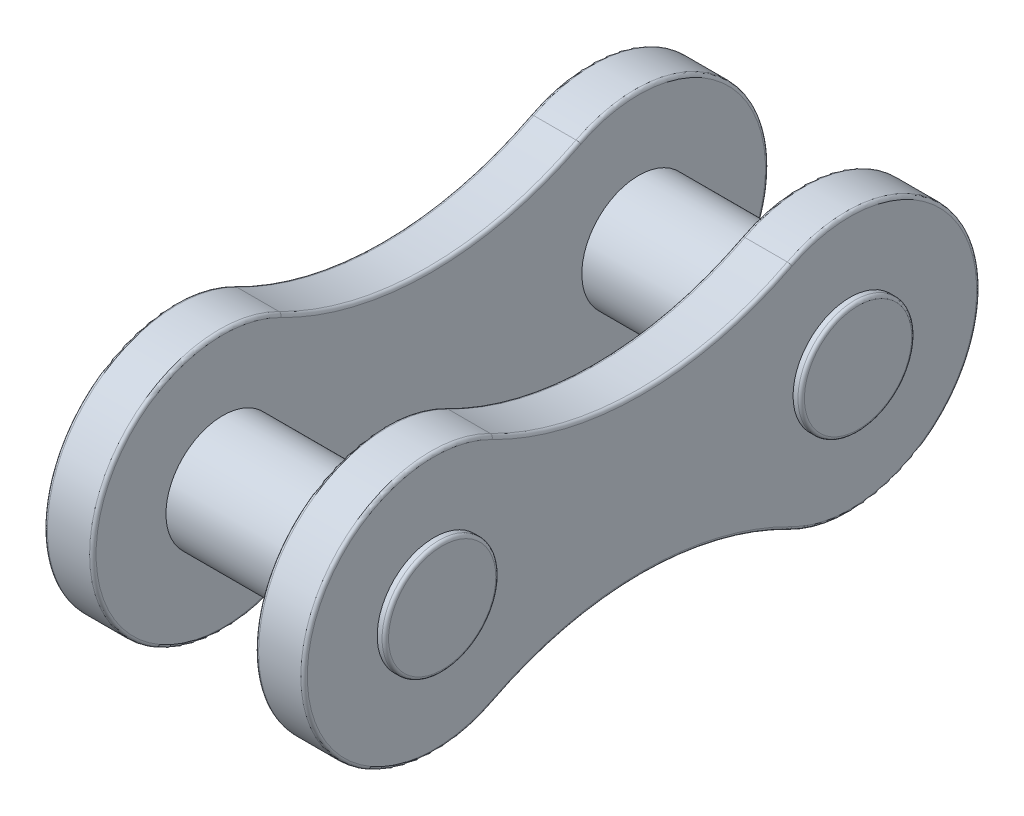
ISO-10303-21;
HEADER;
FILE_DESCRIPTION(('STEP AP214'),'2;1');
FILE_NAME('part.step','',(''),(''),'','','');
FILE_SCHEMA(('AUTOMOTIVE_DESIGN { 1 0 10303 214 1 1 1 1 }'));
ENDSEC;
DATA;
#1=APPLICATION_CONTEXT('core data for automotive mechanical design processes');
#2=APPLICATION_PROTOCOL_DEFINITION('international standard','automotive_design',2000,#1);
#3=PRODUCT_CONTEXT('',#1,'mechanical');
#4=PRODUCT('Part','Part','',(#3));
#5=PRODUCT_RELATED_PRODUCT_CATEGORY('part','',(#4));
#6=PRODUCT_DEFINITION_FORMATION('','',#4);
#7=PRODUCT_DEFINITION_CONTEXT('part definition',#1,'design');
#8=PRODUCT_DEFINITION('design','',#6,#7);
#9=PRODUCT_DEFINITION_SHAPE('','',#8);
#10=(LENGTH_UNIT() NAMED_UNIT(*) SI_UNIT(.MILLI.,.METRE.));
#11=(NAMED_UNIT(*) PLANE_ANGLE_UNIT() SI_UNIT($,.RADIAN.));
#12=(NAMED_UNIT(*) SI_UNIT($,.STERADIAN.) SOLID_ANGLE_UNIT());
#13=UNCERTAINTY_MEASURE_WITH_UNIT(LENGTH_MEASURE(1.E-05),#10,'distance_accuracy_value','');
#14=(GEOMETRIC_REPRESENTATION_CONTEXT(3) GLOBAL_UNCERTAINTY_ASSIGNED_CONTEXT((#13)) GLOBAL_UNIT_ASSIGNED_CONTEXT((#10,
#11,#12)) REPRESENTATION_CONTEXT('',''));
#15=CARTESIAN_POINT('',(0.,0.,0.));
#16=DIRECTION('',(0.,0.,1.));
#17=DIRECTION('',(1.,0.,0.));
#18=AXIS2_PLACEMENT_3D('',#15,#16,#17);
#19=CARTESIAN_POINT('',(4.,6.22613840494251,-3.19925));
#20=DIRECTION('',(1.,0.,0.));
#21=DIRECTION('',(0.,0.,-1.));
#22=AXIS2_PLACEMENT_3D('',#19,#20,#21);
#23=PLANE('',#22);
#24=CARTESIAN_POINT('',(4.,-12.452276809885,0.));
#25=DIRECTION('',(1.,0.,0.));
#26=DIRECTION('',(0.,0.,-1.));
#27=AXIS2_PLACEMENT_3D('',#24,#25,#26);
#28=CIRCLE('',#27,10.1);
#29=CARTESIAN_POINT('',(4.,-3.46884853989654,4.61606071428572));
#30=VERTEX_POINT('',#29);
#31=CARTESIAN_POINT('',(4.,-3.46884853989654,-4.61606071428572));
#32=VERTEX_POINT('',#31);
#33=EDGE_CURVE('E183',#30,#32,#28,.F.);
#34=ORIENTED_EDGE('',*,*,#33,.T.);
#35=CARTESIAN_POINT('',(4.,0.,-6.3985));
#36=DIRECTION('',(1.,0.,0.));
#37=DIRECTION('',(0.,0.,-1.));
#38=AXIS2_PLACEMENT_3D('',#35,#36,#37);
#39=CIRCLE('',#38,3.9);
#40=CARTESIAN_POINT('',(4.,3.46884853989654,-4.61606071428572));
#41=VERTEX_POINT('',#40);
#42=EDGE_CURVE('E161',#32,#41,#39,.T.);
#43=ORIENTED_EDGE('',*,*,#42,.T.);
#44=CARTESIAN_POINT('',(4.,12.452276809885,0.));
#45=DIRECTION('',(1.,0.,0.));
#46=DIRECTION('',(0.,0.,-1.));
#47=AXIS2_PLACEMENT_3D('',#44,#45,#46);
#48=CIRCLE('',#47,10.1);
#49=CARTESIAN_POINT('',(4.,3.46884853989654,4.61606071428571));
#50=VERTEX_POINT('',#49);
#51=EDGE_CURVE('E171',#41,#50,#48,.F.);
#52=ORIENTED_EDGE('',*,*,#51,.T.);
#53=CARTESIAN_POINT('',(4.,0.,6.3985));
#54=DIRECTION('',(1.,0.,0.));
#55=DIRECTION('',(0.,0.,-1.));
#56=AXIS2_PLACEMENT_3D('',#53,#54,#55);
#57=CIRCLE('',#56,3.9);
#58=EDGE_CURVE('E178',#50,#30,#57,.T.);
#59=ORIENTED_EDGE('',*,*,#58,.T.);
#60=EDGE_LOOP('',(#34,#43,#52,#59));
#61=FACE_BOUND('',#60,.T.);
#62=CARTESIAN_POINT('',(4.,0.,6.3985));
#63=DIRECTION('',(1.,0.,0.));
#64=DIRECTION('',(0.,0.,-1.));
#65=AXIS2_PLACEMENT_3D('',#62,#63,#64);
#66=CIRCLE('',#65,1.74999999999992);
#67=CARTESIAN_POINT('',(4.,0.,4.64850000000008));
#68=VERTEX_POINT('',#67);
#69=EDGE_CURVE('E402',#68,#68,#66,.T.);
#70=ORIENTED_EDGE('',*,*,#69,.F.);
#71=EDGE_LOOP('',(#70));
#72=FACE_BOUND('',#71,.T.);
#73=CARTESIAN_POINT('',(4.,0.,-6.3985));
#74=DIRECTION('',(1.,0.,0.));
#75=DIRECTION('',(0.,0.,1.));
#76=AXIS2_PLACEMENT_3D('',#73,#74,#75);
#77=CIRCLE('',#76,1.74999999999992);
#78=CARTESIAN_POINT('',(4.,0.,-4.64850000000008));
#79=VERTEX_POINT('',#78);
#80=EDGE_CURVE('E386',#79,#79,#77,.T.);
#81=ORIENTED_EDGE('',*,*,#80,.F.);
#82=EDGE_LOOP('',(#81));
#83=FACE_BOUND('',#82,.T.);
#84=ADVANCED_FACE('F41',(#61,#72,#83),#23,.T.);
#85=CARTESIAN_POINT('',(2.5,6.22613840494251,-3.19925));
#86=DIRECTION('',(1.,0.,0.));
#87=DIRECTION('',(0.,0.,-1.));
#88=AXIS2_PLACEMENT_3D('',#85,#86,#87);
#89=PLANE('',#88);
#90=CARTESIAN_POINT('',(2.5,12.452276809885,0.));
#91=DIRECTION('',(1.,0.,0.));
#92=DIRECTION('',(0.,0.,-1.));
#93=AXIS2_PLACEMENT_3D('',#90,#91,#92);
#94=CIRCLE('',#93,10.1);
#95=CARTESIAN_POINT('',(2.5,3.46884853989654,4.61606071428571));
#96=VERTEX_POINT('',#95);
#97=CARTESIAN_POINT('',(2.5,3.46884853989654,-4.61606071428572));
#98=VERTEX_POINT('',#97);
#99=EDGE_CURVE('E210',#96,#98,#94,.T.);
#100=ORIENTED_EDGE('',*,*,#99,.T.);
#101=CARTESIAN_POINT('',(2.5,0.,-6.3985));
#102=DIRECTION('',(1.,0.,0.));
#103=DIRECTION('',(0.,0.,-1.));
#104=AXIS2_PLACEMENT_3D('',#101,#102,#103);
#105=CIRCLE('',#104,3.9);
#106=CARTESIAN_POINT('',(2.5,-3.46884853989654,-4.61606071428572));
#107=VERTEX_POINT('',#106);
#108=EDGE_CURVE('E219',#98,#107,#105,.F.);
#109=ORIENTED_EDGE('',*,*,#108,.T.);
#110=CARTESIAN_POINT('',(2.5,-12.452276809885,0.));
#111=DIRECTION('',(1.,0.,0.));
#112=DIRECTION('',(0.,0.,-1.));
#113=AXIS2_PLACEMENT_3D('',#110,#111,#112);
#114=CIRCLE('',#113,10.1);
#115=CARTESIAN_POINT('',(2.5,-3.46884853989654,4.61606071428572));
#116=VERTEX_POINT('',#115);
#117=EDGE_CURVE('E216',#107,#116,#114,.T.);
#118=ORIENTED_EDGE('',*,*,#117,.T.);
#119=CARTESIAN_POINT('',(2.5,0.,6.3985));
#120=DIRECTION('',(1.,0.,0.));
#121=DIRECTION('',(0.,0.,-1.));
#122=AXIS2_PLACEMENT_3D('',#119,#120,#121);
#123=CIRCLE('',#122,3.9);
#124=EDGE_CURVE('E213',#116,#96,#123,.F.);
#125=ORIENTED_EDGE('',*,*,#124,.T.);
#126=EDGE_LOOP('',(#100,#109,#118,#125));
#127=FACE_BOUND('',#126,.T.);
#128=CARTESIAN_POINT('',(2.5,0.,6.3985));
#129=DIRECTION('',(1.,0.,0.));
#130=DIRECTION('',(0.,0.,-1.));
#131=AXIS2_PLACEMENT_3D('',#128,#129,#130);
#132=CIRCLE('',#131,1.74999999999992);
#133=CARTESIAN_POINT('',(2.5,0.,4.64850000000008));
#134=VERTEX_POINT('',#133);
#135=EDGE_CURVE('E473',#134,#134,#132,.F.);
#136=ORIENTED_EDGE('',*,*,#135,.F.);
#137=EDGE_LOOP('',(#136));
#138=FACE_BOUND('',#137,.T.);
#139=CARTESIAN_POINT('',(2.5,0.,-6.3985));
#140=DIRECTION('',(1.,0.,0.));
#141=DIRECTION('',(0.,0.,-1.));
#142=AXIS2_PLACEMENT_3D('',#139,#140,#141);
#143=CIRCLE('',#142,1.74999999999992);
#144=CARTESIAN_POINT('',(2.5,0.,-8.14849999999992));
#145=VERTEX_POINT('',#144);
#146=EDGE_CURVE('E379',#145,#145,#143,.F.);
#147=ORIENTED_EDGE('',*,*,#146,.F.);
#148=EDGE_LOOP('',(#147));
#149=FACE_BOUND('',#148,.T.);
#150=ADVANCED_FACE('F466',(#127,#138,#149),#89,.F.);
#151=CARTESIAN_POINT('',(4.,12.452276809885,0.));
#152=DIRECTION('',(-1.,0.,0.));
#153=DIRECTION('',(0.,0.,1.));
#154=AXIS2_PLACEMENT_3D('',#151,#152,#153);
#155=CYLINDRICAL_SURFACE('',#154,10.);
#156=DIRECTION('',(-1.,0.,0.));
#157=VECTOR('',#156,1.);
#158=CARTESIAN_POINT('',(4.,3.55779337425286,4.57035714285714));
#159=LINE('',#158,#157);
#160=CARTESIAN_POINT('',(3.9,3.55779337425286,4.57035714285714));
#161=VERTEX_POINT('',#160);
#162=CARTESIAN_POINT('',(2.6,3.55779337425286,4.57035714285714));
#163=VERTEX_POINT('',#162);
#164=EDGE_CURVE('E418',#161,#163,#159,.T.);
#165=ORIENTED_EDGE('',*,*,#164,.F.);
#166=CARTESIAN_POINT('',(3.9,12.452276809885,0.));
#167=DIRECTION('',(1.,0.,0.));
#168=DIRECTION('',(0.,0.,-1.));
#169=AXIS2_PLACEMENT_3D('',#166,#167,#168);
#170=CIRCLE('',#169,10.);
#171=CARTESIAN_POINT('',(3.9,3.55779337425286,-4.57035714285714));
#172=VERTEX_POINT('',#171);
#173=EDGE_CURVE('E269',#161,#172,#170,.T.);
#174=ORIENTED_EDGE('',*,*,#173,.T.);
#175=DIRECTION('',(-1.,0.,0.));
#176=VECTOR('',#175,1.);
#177=CARTESIAN_POINT('',(4.,3.55779337425286,-4.57035714285714));
#178=LINE('',#177,#176);
#179=CARTESIAN_POINT('',(2.6,3.55779337425286,-4.57035714285714));
#180=VERTEX_POINT('',#179);
#181=EDGE_CURVE('E406',#172,#180,#178,.T.);
#182=ORIENTED_EDGE('',*,*,#181,.T.);
#183=CARTESIAN_POINT('',(2.6,12.452276809885,0.));
#184=DIRECTION('',(1.,0.,0.));
#185=DIRECTION('',(0.,0.,-1.));
#186=AXIS2_PLACEMENT_3D('',#183,#184,#185);
#187=CIRCLE('',#186,10.);
#188=EDGE_CURVE('E266',#180,#163,#187,.F.);
#189=ORIENTED_EDGE('',*,*,#188,.T.);
#190=EDGE_LOOP('',(#165,#174,#182,#189));
#191=FACE_BOUND('',#190,.T.);
#192=ADVANCED_FACE('F454',(#191),#155,.F.);
#193=CARTESIAN_POINT('',(4.,0.,6.3985));
#194=DIRECTION('',(-1.,0.,0.));
#195=DIRECTION('',(0.,0.,1.));
#196=AXIS2_PLACEMENT_3D('',#193,#194,#195);
#197=CYLINDRICAL_SURFACE('',#196,4.);
#198=DIRECTION('',(-1.,0.,0.));
#199=VECTOR('',#198,1.);
#200=CARTESIAN_POINT('',(4.,-3.55779337425286,4.57035714285715));
#201=LINE('',#200,#199);
#202=CARTESIAN_POINT('',(3.9,-3.55779337425286,4.57035714285715));
#203=VERTEX_POINT('',#202);
#204=CARTESIAN_POINT('',(2.6,-3.55779337425286,4.57035714285715));
#205=VERTEX_POINT('',#204);
#206=EDGE_CURVE('E414',#203,#205,#201,.T.);
#207=ORIENTED_EDGE('',*,*,#206,.F.);
#208=CARTESIAN_POINT('',(3.9,0.,6.3985));
#209=DIRECTION('',(1.,0.,0.));
#210=DIRECTION('',(0.,0.,-1.));
#211=AXIS2_PLACEMENT_3D('',#208,#209,#210);
#212=CIRCLE('',#211,4.);
#213=EDGE_CURVE('E207',#203,#161,#212,.F.);
#214=ORIENTED_EDGE('',*,*,#213,.T.);
#215=ORIENTED_EDGE('',*,*,#164,.T.);
#216=CARTESIAN_POINT('',(2.6,0.,6.3985));
#217=DIRECTION('',(1.,0.,0.));
#218=DIRECTION('',(0.,0.,-1.));
#219=AXIS2_PLACEMENT_3D('',#216,#217,#218);
#220=CIRCLE('',#219,4.);
#221=EDGE_CURVE('E204',#163,#205,#220,.T.);
#222=ORIENTED_EDGE('',*,*,#221,.T.);
#223=EDGE_LOOP('',(#207,#214,#215,#222));
#224=FACE_BOUND('',#223,.T.);
#225=ADVANCED_FACE('F457',(#224),#197,.T.);
#226=CARTESIAN_POINT('',(4.,-12.452276809885,0.));
#227=DIRECTION('',(-1.,0.,0.));
#228=DIRECTION('',(0.,0.,1.));
#229=AXIS2_PLACEMENT_3D('',#226,#227,#228);
#230=CYLINDRICAL_SURFACE('',#229,10.);
#231=DIRECTION('',(-1.,0.,0.));
#232=VECTOR('',#231,1.);
#233=CARTESIAN_POINT('',(4.,-3.55779337425286,-4.57035714285714));
#234=LINE('',#233,#232);
#235=CARTESIAN_POINT('',(3.9,-3.55779337425286,-4.57035714285714));
#236=VERTEX_POINT('',#235);
#237=CARTESIAN_POINT('',(2.6,-3.55779337425286,-4.57035714285714));
#238=VERTEX_POINT('',#237);
#239=EDGE_CURVE('E410',#236,#238,#234,.T.);
#240=ORIENTED_EDGE('',*,*,#239,.F.);
#241=CARTESIAN_POINT('',(3.9,-12.452276809885,0.));
#242=DIRECTION('',(1.,0.,0.));
#243=DIRECTION('',(0.,0.,-1.));
#244=AXIS2_PLACEMENT_3D('',#241,#242,#243);
#245=CIRCLE('',#244,10.);
#246=EDGE_CURVE('E201',#236,#203,#245,.T.);
#247=ORIENTED_EDGE('',*,*,#246,.T.);
#248=ORIENTED_EDGE('',*,*,#206,.T.);
#249=CARTESIAN_POINT('',(2.6,-12.452276809885,0.));
#250=DIRECTION('',(1.,0.,0.));
#251=DIRECTION('',(0.,0.,-1.));
#252=AXIS2_PLACEMENT_3D('',#249,#250,#251);
#253=CIRCLE('',#252,10.);
#254=EDGE_CURVE('E198',#205,#238,#253,.F.);
#255=ORIENTED_EDGE('',*,*,#254,.T.);
#256=EDGE_LOOP('',(#240,#247,#248,#255));
#257=FACE_BOUND('',#256,.T.);
#258=ADVANCED_FACE('F440',(#257),#230,.F.);
#259=CARTESIAN_POINT('',(4.,0.,-6.3985));
#260=DIRECTION('',(-1.,0.,0.));
#261=DIRECTION('',(0.,0.,1.));
#262=AXIS2_PLACEMENT_3D('',#259,#260,#261);
#263=CYLINDRICAL_SURFACE('',#262,4.);
#264=ORIENTED_EDGE('',*,*,#181,.F.);
#265=CARTESIAN_POINT('',(3.9,0.,-6.3985));
#266=DIRECTION('',(1.,0.,0.));
#267=DIRECTION('',(0.,0.,-1.));
#268=AXIS2_PLACEMENT_3D('',#265,#266,#267);
#269=CIRCLE('',#268,4.);
#270=EDGE_CURVE('E163',#172,#236,#269,.F.);
#271=ORIENTED_EDGE('',*,*,#270,.T.);
#272=ORIENTED_EDGE('',*,*,#239,.T.);
#273=CARTESIAN_POINT('',(2.6,0.,-6.3985));
#274=DIRECTION('',(1.,0.,0.));
#275=DIRECTION('',(0.,0.,-1.));
#276=AXIS2_PLACEMENT_3D('',#273,#274,#275);
#277=CIRCLE('',#276,4.);
#278=EDGE_CURVE('E186',#238,#180,#277,.T.);
#279=ORIENTED_EDGE('',*,*,#278,.T.);
#280=EDGE_LOOP('',(#264,#271,#272,#279));
#281=FACE_BOUND('',#280,.T.);
#282=ADVANCED_FACE('F438',(#281),#263,.T.);
#283=CARTESIAN_POINT('',(4.25,0.,-6.3985));
#284=DIRECTION('',(-1.,0.,0.));
#285=DIRECTION('',(0.,0.,1.));
#286=AXIS2_PLACEMENT_3D('',#283,#284,#285);
#287=CYLINDRICAL_SURFACE('',#286,1.74999999999992);
#288=CARTESIAN_POINT('',(-2.5,0.,-6.3985));
#289=DIRECTION('',(1.,0.,0.));
#290=DIRECTION('',(0.,0.,-1.));
#291=AXIS2_PLACEMENT_3D('',#288,#289,#290);
#292=CIRCLE('',#291,1.74999999999992);
#293=CARTESIAN_POINT('',(-2.5,0.,-8.14849999999992));
#294=VERTEX_POINT('',#293);
#295=EDGE_CURVE('E391',#294,#294,#292,.T.);
#296=ORIENTED_EDGE('',*,*,#295,.T.);
#297=EDGE_LOOP('',(#296));
#298=FACE_BOUND('',#297,.T.);
#299=ORIENTED_EDGE('',*,*,#146,.T.);
#300=EDGE_LOOP('',(#299));
#301=FACE_BOUND('',#300,.T.);
#302=ADVANCED_FACE('F476',(#298,#301),#287,.T.);
#303=CARTESIAN_POINT('',(4.15,0.,-6.3985));
#304=DIRECTION('',(1.,0.,0.));
#305=DIRECTION('',(0.,0.,-1.));
#306=AXIS2_PLACEMENT_3D('',#303,#304,#305);
#307=CIRCLE('',#306,1.74999999999992);
#308=CARTESIAN_POINT('',(4.15,0.,-8.14849999999992));
#309=VERTEX_POINT('',#308);
#310=EDGE_CURVE('E292',#309,#309,#307,.F.);
#311=ORIENTED_EDGE('',*,*,#310,.T.);
#312=EDGE_LOOP('',(#311));
#313=FACE_BOUND('',#312,.T.);
#314=ORIENTED_EDGE('',*,*,#80,.T.);
#315=EDGE_LOOP('',(#314));
#316=FACE_BOUND('',#315,.T.);
#317=ADVANCED_FACE('F478',(#313,#316),#287,.T.);
#318=CARTESIAN_POINT('',(4.25,0.,-6.3985));
#319=DIRECTION('',(1.,0.,0.));
#320=DIRECTION('',(0.,0.,-1.));
#321=AXIS2_PLACEMENT_3D('',#318,#319,#320);
#322=PLANE('',#321);
#323=CARTESIAN_POINT('',(4.25,0.,-6.3985));
#324=DIRECTION('',(1.,0.,0.));
#325=DIRECTION('',(0.,0.,-1.));
#326=AXIS2_PLACEMENT_3D('',#323,#324,#325);
#327=CIRCLE('',#326,1.64999999999992);
#328=CARTESIAN_POINT('',(4.25,0.,-8.04849999999992));
#329=VERTEX_POINT('',#328);
#330=EDGE_CURVE('E288',#329,#329,#327,.T.);
#331=ORIENTED_EDGE('',*,*,#330,.T.);
#332=EDGE_LOOP('',(#331));
#333=FACE_BOUND('',#332,.T.);
#334=ADVANCED_FACE('F486',(#333),#322,.T.);
#335=CARTESIAN_POINT('',(-4.,0.,6.3985));
#336=DIRECTION('',(1.,0.,0.));
#337=DIRECTION('',(0.,0.,-1.));
#338=AXIS2_PLACEMENT_3D('',#335,#336,#337);
#339=CYLINDRICAL_SURFACE('',#338,4.);
#340=DIRECTION('',(1.,0.,0.));
#341=VECTOR('',#340,1.);
#342=CARTESIAN_POINT('',(-4.,3.55779337425286,4.57035714285714));
#343=LINE('',#342,#341);
#344=CARTESIAN_POINT('',(-3.9,3.55779337425286,4.57035714285714));
#345=VERTEX_POINT('',#344);
#346=CARTESIAN_POINT('',(-2.6,3.55779337425286,4.57035714285714));
#347=VERTEX_POINT('',#346);
#348=EDGE_CURVE('E369',#345,#347,#343,.T.);
#349=ORIENTED_EDGE('',*,*,#348,.F.);
#350=CARTESIAN_POINT('',(-3.9,0.,6.3985));
#351=DIRECTION('',(1.,0.,0.));
#352=DIRECTION('',(0.,0.,-1.));
#353=AXIS2_PLACEMENT_3D('',#350,#351,#352);
#354=CIRCLE('',#353,4.);
#355=CARTESIAN_POINT('',(-3.9,-3.55779337425286,4.57035714285715));
#356=VERTEX_POINT('',#355);
#357=EDGE_CURVE('E253',#345,#356,#354,.T.);
#358=ORIENTED_EDGE('',*,*,#357,.T.);
#359=DIRECTION('',(1.,0.,0.));
#360=VECTOR('',#359,1.);
#361=CARTESIAN_POINT('',(-4.,-3.55779337425286,4.57035714285715));
#362=LINE('',#361,#360);
#363=CARTESIAN_POINT('',(-2.6,-3.55779337425286,4.57035714285715));
#364=VERTEX_POINT('',#363);
#365=EDGE_CURVE('E372',#356,#364,#362,.T.);
#366=ORIENTED_EDGE('',*,*,#365,.T.);
#367=CARTESIAN_POINT('',(-2.6,0.,6.3985));
#368=DIRECTION('',(1.,0.,0.));
#369=DIRECTION('',(0.,0.,-1.));
#370=AXIS2_PLACEMENT_3D('',#367,#368,#369);
#371=CIRCLE('',#370,4.);
#372=EDGE_CURVE('E250',#364,#347,#371,.F.);
#373=ORIENTED_EDGE('',*,*,#372,.T.);
#374=EDGE_LOOP('',(#349,#358,#366,#373));
#375=FACE_BOUND('',#374,.T.);
#376=ADVANCED_FACE('F368',(#375),#339,.T.);
#377=CARTESIAN_POINT('',(-4.,12.452276809885,0.));
#378=DIRECTION('',(1.,0.,0.));
#379=DIRECTION('',(0.,0.,-1.));
#380=AXIS2_PLACEMENT_3D('',#377,#378,#379);
#381=CYLINDRICAL_SURFACE('',#380,10.);
#382=DIRECTION('',(1.,0.,0.));
#383=VECTOR('',#382,1.);
#384=CARTESIAN_POINT('',(-4.,3.55779337425286,-4.57035714285714));
#385=LINE('',#384,#383);
#386=CARTESIAN_POINT('',(-3.9,3.55779337425286,-4.57035714285714));
#387=VERTEX_POINT('',#386);
#388=CARTESIAN_POINT('',(-2.6,3.55779337425286,-4.57035714285714));
#389=VERTEX_POINT('',#388);
#390=EDGE_CURVE('E380',#387,#389,#385,.T.);
#391=ORIENTED_EDGE('',*,*,#390,.F.);
#392=CARTESIAN_POINT('',(-3.9,12.452276809885,0.));
#393=DIRECTION('',(1.,0.,0.));
#394=DIRECTION('',(0.,0.,-1.));
#395=AXIS2_PLACEMENT_3D('',#392,#393,#394);
#396=CIRCLE('',#395,10.);
#397=EDGE_CURVE('E11',#387,#345,#396,.F.);
#398=ORIENTED_EDGE('',*,*,#397,.T.);
#399=ORIENTED_EDGE('',*,*,#348,.T.);
#400=CARTESIAN_POINT('',(-2.6,12.452276809885,0.));
#401=DIRECTION('',(1.,0.,0.));
#402=DIRECTION('',(0.,0.,-1.));
#403=AXIS2_PLACEMENT_3D('',#400,#401,#402);
#404=CIRCLE('',#403,10.);
#405=EDGE_CURVE('E51',#347,#389,#404,.T.);
#406=ORIENTED_EDGE('',*,*,#405,.T.);
#407=EDGE_LOOP('',(#391,#398,#399,#406));
#408=FACE_BOUND('',#407,.T.);
#409=ADVANCED_FACE('F375',(#408),#381,.F.);
#410=CARTESIAN_POINT('',(-4.,0.,-6.3985));
#411=DIRECTION('',(1.,0.,0.));
#412=DIRECTION('',(0.,0.,-1.));
#413=AXIS2_PLACEMENT_3D('',#410,#411,#412);
#414=CYLINDRICAL_SURFACE('',#413,4.);
#415=DIRECTION('',(1.,0.,0.));
#416=VECTOR('',#415,1.);
#417=CARTESIAN_POINT('',(-4.,-3.55779337425286,-4.57035714285714));
#418=LINE('',#417,#416);
#419=CARTESIAN_POINT('',(-3.9,-3.55779337425286,-4.57035714285714));
#420=VERTEX_POINT('',#419);
#421=CARTESIAN_POINT('',(-2.6,-3.55779337425286,-4.57035714285714));
#422=VERTEX_POINT('',#421);
#423=EDGE_CURVE('E388',#420,#422,#418,.T.);
#424=ORIENTED_EDGE('',*,*,#423,.F.);
#425=CARTESIAN_POINT('',(-3.9,0.,-6.3985));
#426=DIRECTION('',(1.,0.,0.));
#427=DIRECTION('',(0.,0.,-1.));
#428=AXIS2_PLACEMENT_3D('',#425,#426,#427);
#429=CIRCLE('',#428,4.);
#430=EDGE_CURVE('E227',#420,#387,#429,.T.);
#431=ORIENTED_EDGE('',*,*,#430,.T.);
#432=ORIENTED_EDGE('',*,*,#390,.T.);
#433=CARTESIAN_POINT('',(-2.6,0.,-6.3985));
#434=DIRECTION('',(1.,0.,0.));
#435=DIRECTION('',(0.,0.,-1.));
#436=AXIS2_PLACEMENT_3D('',#433,#434,#435);
#437=CIRCLE('',#436,4.);
#438=EDGE_CURVE('E223',#389,#422,#437,.F.);
#439=ORIENTED_EDGE('',*,*,#438,.T.);
#440=EDGE_LOOP('',(#424,#431,#432,#439));
#441=FACE_BOUND('',#440,.T.);
#442=ADVANCED_FACE('F596',(#441),#414,.T.);
#443=CARTESIAN_POINT('',(-4.,-12.452276809885,0.));
#444=DIRECTION('',(1.,0.,0.));
#445=DIRECTION('',(0.,0.,-1.));
#446=AXIS2_PLACEMENT_3D('',#443,#444,#445);
#447=CYLINDRICAL_SURFACE('',#446,10.);
#448=ORIENTED_EDGE('',*,*,#365,.F.);
#449=CARTESIAN_POINT('',(-3.9,-12.452276809885,0.));
#450=DIRECTION('',(1.,0.,0.));
#451=DIRECTION('',(0.,0.,-1.));
#452=AXIS2_PLACEMENT_3D('',#449,#450,#451);
#453=CIRCLE('',#452,10.);
#454=EDGE_CURVE('E247',#356,#420,#453,.F.);
#455=ORIENTED_EDGE('',*,*,#454,.T.);
#456=ORIENTED_EDGE('',*,*,#423,.T.);
#457=CARTESIAN_POINT('',(-2.6,-12.452276809885,0.));
#458=DIRECTION('',(1.,0.,0.));
#459=DIRECTION('',(0.,0.,-1.));
#460=AXIS2_PLACEMENT_3D('',#457,#458,#459);
#461=CIRCLE('',#460,10.);
#462=EDGE_CURVE('E244',#422,#364,#461,.T.);
#463=ORIENTED_EDGE('',*,*,#462,.T.);
#464=EDGE_LOOP('',(#448,#455,#456,#463));
#465=FACE_BOUND('',#464,.T.);
#466=ADVANCED_FACE('F590',(#465),#447,.F.);
#467=CARTESIAN_POINT('',(-4.,-6.22613840494251,3.19925));
#468=DIRECTION('',(1.,0.,0.));
#469=DIRECTION('',(0.,0.,-1.));
#470=AXIS2_PLACEMENT_3D('',#467,#468,#469);
#471=PLANE('',#470);
#472=CARTESIAN_POINT('',(-4.,12.452276809885,0.));
#473=DIRECTION('',(1.,0.,0.));
#474=DIRECTION('',(0.,0.,-1.));
#475=AXIS2_PLACEMENT_3D('',#472,#473,#474);
#476=CIRCLE('',#475,10.1);
#477=CARTESIAN_POINT('',(-4.,3.46884853989654,4.61606071428571));
#478=VERTEX_POINT('',#477);
#479=CARTESIAN_POINT('',(-4.,3.46884853989654,-4.61606071428571));
#480=VERTEX_POINT('',#479);
#481=EDGE_CURVE('E231',#478,#480,#476,.T.);
#482=ORIENTED_EDGE('',*,*,#481,.T.);
#483=CARTESIAN_POINT('',(-4.,0.,-6.3985));
#484=DIRECTION('',(1.,0.,0.));
#485=DIRECTION('',(0.,0.,-1.));
#486=AXIS2_PLACEMENT_3D('',#483,#484,#485);
#487=CIRCLE('',#486,3.9);
#488=CARTESIAN_POINT('',(-4.,-3.46884853989654,-4.61606071428572));
#489=VERTEX_POINT('',#488);
#490=EDGE_CURVE('E240',#480,#489,#487,.F.);
#491=ORIENTED_EDGE('',*,*,#490,.T.);
#492=CARTESIAN_POINT('',(-4.,-12.452276809885,0.));
#493=DIRECTION('',(1.,0.,0.));
#494=DIRECTION('',(0.,0.,-1.));
#495=AXIS2_PLACEMENT_3D('',#492,#493,#494);
#496=CIRCLE('',#495,10.1);
#497=CARTESIAN_POINT('',(-4.,-3.46884853989654,4.61606071428572));
#498=VERTEX_POINT('',#497);
#499=EDGE_CURVE('E237',#489,#498,#496,.T.);
#500=ORIENTED_EDGE('',*,*,#499,.T.);
#501=CARTESIAN_POINT('',(-4.,0.,6.3985));
#502=DIRECTION('',(1.,0.,0.));
#503=DIRECTION('',(0.,0.,-1.));
#504=AXIS2_PLACEMENT_3D('',#501,#502,#503);
#505=CIRCLE('',#504,3.9);
#506=EDGE_CURVE('E234',#498,#478,#505,.F.);
#507=ORIENTED_EDGE('',*,*,#506,.T.);
#508=EDGE_LOOP('',(#482,#491,#500,#507));
#509=FACE_BOUND('',#508,.T.);
#510=CARTESIAN_POINT('',(-4.,0.,6.3985));
#511=DIRECTION('',(1.,0.,0.));
#512=DIRECTION('',(0.,0.,-1.));
#513=AXIS2_PLACEMENT_3D('',#510,#511,#512);
#514=CIRCLE('',#513,1.74999999999992);
#515=CARTESIAN_POINT('',(-4.,0.,4.64850000000008));
#516=VERTEX_POINT('',#515);
#517=EDGE_CURVE('E314',#516,#516,#514,.F.);
#518=ORIENTED_EDGE('',*,*,#517,.F.);
#519=EDGE_LOOP('',(#518));
#520=FACE_BOUND('',#519,.T.);
#521=CARTESIAN_POINT('',(-4.,0.,-6.3985));
#522=DIRECTION('',(1.,0.,0.));
#523=DIRECTION('',(0.,0.,-1.));
#524=AXIS2_PLACEMENT_3D('',#521,#522,#523);
#525=CIRCLE('',#524,1.74999999999992);
#526=CARTESIAN_POINT('',(-4.,0.,-8.14849999999992));
#527=VERTEX_POINT('',#526);
#528=EDGE_CURVE('E179',#527,#527,#525,.T.);
#529=ORIENTED_EDGE('',*,*,#528,.T.);
#530=EDGE_LOOP('',(#529));
#531=FACE_BOUND('',#530,.T.);
#532=ADVANCED_FACE('F581',(#509,#520,#531),#471,.F.);
#533=CARTESIAN_POINT('',(-2.5,-6.22613840494251,3.19925));
#534=DIRECTION('',(1.,0.,0.));
#535=DIRECTION('',(0.,0.,-1.));
#536=AXIS2_PLACEMENT_3D('',#533,#534,#535);
#537=PLANE('',#536);
#538=CARTESIAN_POINT('',(-2.5,-12.452276809885,0.));
#539=DIRECTION('',(1.,0.,0.));
#540=DIRECTION('',(0.,0.,-1.));
#541=AXIS2_PLACEMENT_3D('',#538,#539,#540);
#542=CIRCLE('',#541,10.1);
#543=CARTESIAN_POINT('',(-2.5,-3.46884853989654,4.61606071428572));
#544=VERTEX_POINT('',#543);
#545=CARTESIAN_POINT('',(-2.5,-3.46884853989654,-4.61606071428572));
#546=VERTEX_POINT('',#545);
#547=EDGE_CURVE('E59',#544,#546,#542,.F.);
#548=ORIENTED_EDGE('',*,*,#547,.T.);
#549=CARTESIAN_POINT('',(-2.5,0.,-6.3985));
#550=DIRECTION('',(1.,0.,0.));
#551=DIRECTION('',(0.,0.,-1.));
#552=AXIS2_PLACEMENT_3D('',#549,#550,#551);
#553=CIRCLE('',#552,3.9);
#554=CARTESIAN_POINT('',(-2.5,3.46884853989654,-4.61606071428571));
#555=VERTEX_POINT('',#554);
#556=EDGE_CURVE('E263',#546,#555,#553,.T.);
#557=ORIENTED_EDGE('',*,*,#556,.T.);
#558=CARTESIAN_POINT('',(-2.5,12.452276809885,0.));
#559=DIRECTION('',(1.,0.,0.));
#560=DIRECTION('',(0.,0.,-1.));
#561=AXIS2_PLACEMENT_3D('',#558,#559,#560);
#562=CIRCLE('',#561,10.1);
#563=CARTESIAN_POINT('',(-2.5,3.46884853989654,4.61606071428571));
#564=VERTEX_POINT('',#563);
#565=EDGE_CURVE('E256',#555,#564,#562,.F.);
#566=ORIENTED_EDGE('',*,*,#565,.T.);
#567=CARTESIAN_POINT('',(-2.5,0.,6.3985));
#568=DIRECTION('',(1.,0.,0.));
#569=DIRECTION('',(0.,0.,-1.));
#570=AXIS2_PLACEMENT_3D('',#567,#568,#569);
#571=CIRCLE('',#570,3.9);
#572=EDGE_CURVE('E64',#564,#544,#571,.T.);
#573=ORIENTED_EDGE('',*,*,#572,.T.);
#574=EDGE_LOOP('',(#548,#557,#566,#573));
#575=FACE_BOUND('',#574,.T.);
#576=CARTESIAN_POINT('',(-2.5,0.,6.3985));
#577=DIRECTION('',(1.,0.,0.));
#578=DIRECTION('',(0.,0.,-1.));
#579=AXIS2_PLACEMENT_3D('',#576,#577,#578);
#580=CIRCLE('',#579,1.74999999999992);
#581=CARTESIAN_POINT('',(-2.5,0.,4.64850000000008));
#582=VERTEX_POINT('',#581);
#583=EDGE_CURVE('E627',#582,#582,#580,.T.);
#584=ORIENTED_EDGE('',*,*,#583,.F.);
#585=EDGE_LOOP('',(#584));
#586=FACE_BOUND('',#585,.T.);
#587=ORIENTED_EDGE('',*,*,#295,.F.);
#588=EDGE_LOOP('',(#587));
#589=FACE_BOUND('',#588,.T.);
#590=ADVANCED_FACE('F576',(#575,#586,#589),#537,.T.);
#591=CARTESIAN_POINT('',(-4.25,0.,-6.3985));
#592=DIRECTION('',(1.,0.,0.));
#593=DIRECTION('',(0.,0.,-1.));
#594=AXIS2_PLACEMENT_3D('',#591,#592,#593);
#595=PLANE('',#594);
#596=CARTESIAN_POINT('',(-4.25,0.,-6.3985));
#597=DIRECTION('',(1.,0.,0.));
#598=DIRECTION('',(0.,0.,-1.));
#599=AXIS2_PLACEMENT_3D('',#596,#597,#598);
#600=CIRCLE('',#599,1.64999999999992);
#601=CARTESIAN_POINT('',(-4.25,0.,-8.04849999999992));
#602=VERTEX_POINT('',#601);
#603=EDGE_CURVE('E276',#602,#602,#600,.F.);
#604=ORIENTED_EDGE('',*,*,#603,.T.);
#605=EDGE_LOOP('',(#604));
#606=FACE_BOUND('',#605,.T.);
#607=ADVANCED_FACE('F494',(#606),#595,.F.);
#608=CARTESIAN_POINT('',(-4.15,0.,-6.3985));
#609=DIRECTION('',(1.,0.,0.));
#610=DIRECTION('',(0.,0.,-1.));
#611=AXIS2_PLACEMENT_3D('',#608,#609,#610);
#612=CIRCLE('',#611,1.74999999999992);
#613=CARTESIAN_POINT('',(-4.15,0.,-8.14849999999992));
#614=VERTEX_POINT('',#613);
#615=EDGE_CURVE('E272',#614,#614,#612,.T.);
#616=ORIENTED_EDGE('',*,*,#615,.T.);
#617=EDGE_LOOP('',(#616));
#618=FACE_BOUND('',#617,.T.);
#619=ORIENTED_EDGE('',*,*,#528,.F.);
#620=EDGE_LOOP('',(#619));
#621=FACE_BOUND('',#620,.T.);
#622=ADVANCED_FACE('F481',(#618,#621),#287,.T.);
#623=CARTESIAN_POINT('',(4.25,0.,6.3985));
#624=DIRECTION('',(-1.,0.,0.));
#625=DIRECTION('',(0.,0.,1.));
#626=AXIS2_PLACEMENT_3D('',#623,#624,#625);
#627=CYLINDRICAL_SURFACE('',#626,1.74999999999992);
#628=ORIENTED_EDGE('',*,*,#583,.T.);
#629=EDGE_LOOP('',(#628));
#630=FACE_BOUND('',#629,.T.);
#631=ORIENTED_EDGE('',*,*,#135,.T.);
#632=EDGE_LOOP('',(#631));
#633=FACE_BOUND('',#632,.T.);
#634=ADVANCED_FACE('F493',(#630,#633),#627,.T.);
#635=CARTESIAN_POINT('',(-4.25,0.,6.3985));
#636=DIRECTION('',(1.,0.,0.));
#637=DIRECTION('',(0.,0.,-1.));
#638=AXIS2_PLACEMENT_3D('',#635,#636,#637);
#639=PLANE('',#638);
#640=CARTESIAN_POINT('',(-4.25,0.,6.3985));
#641=DIRECTION('',(1.,0.,0.));
#642=DIRECTION('',(0.,0.,-1.));
#643=AXIS2_PLACEMENT_3D('',#640,#641,#642);
#644=CIRCLE('',#643,1.64999999999992);
#645=CARTESIAN_POINT('',(-4.25,0.,4.74850000000008));
#646=VERTEX_POINT('',#645);
#647=EDGE_CURVE('E284',#646,#646,#644,.F.);
#648=ORIENTED_EDGE('',*,*,#647,.T.);
#649=EDGE_LOOP('',(#648));
#650=FACE_BOUND('',#649,.T.);
#651=ADVANCED_FACE('F644',(#650),#639,.F.);
#652=CARTESIAN_POINT('',(-4.15,0.,6.3985));
#653=DIRECTION('',(1.,0.,0.));
#654=DIRECTION('',(0.,0.,-1.));
#655=AXIS2_PLACEMENT_3D('',#652,#653,#654);
#656=CIRCLE('',#655,1.74999999999992);
#657=CARTESIAN_POINT('',(-4.15,0.,4.64850000000008));
#658=VERTEX_POINT('',#657);
#659=EDGE_CURVE('E280',#658,#658,#656,.T.);
#660=ORIENTED_EDGE('',*,*,#659,.T.);
#661=EDGE_LOOP('',(#660));
#662=FACE_BOUND('',#661,.T.);
#663=ORIENTED_EDGE('',*,*,#517,.T.);
#664=EDGE_LOOP('',(#663));
#665=FACE_BOUND('',#664,.T.);
#666=ADVANCED_FACE('F642',(#662,#665),#627,.T.);
#667=CARTESIAN_POINT('',(4.15,0.,6.3985));
#668=DIRECTION('',(1.,0.,0.));
#669=DIRECTION('',(0.,0.,-1.));
#670=AXIS2_PLACEMENT_3D('',#667,#668,#669);
#671=CIRCLE('',#670,1.74999999999992);
#672=CARTESIAN_POINT('',(4.15,0.,4.64850000000008));
#673=VERTEX_POINT('',#672);
#674=EDGE_CURVE('E300',#673,#673,#671,.F.);
#675=ORIENTED_EDGE('',*,*,#674,.T.);
#676=EDGE_LOOP('',(#675));
#677=FACE_BOUND('',#676,.T.);
#678=ORIENTED_EDGE('',*,*,#69,.T.);
#679=EDGE_LOOP('',(#678));
#680=FACE_BOUND('',#679,.T.);
#681=ADVANCED_FACE('F600',(#677,#680),#627,.T.);
#682=CARTESIAN_POINT('',(4.25,0.,6.3985));
#683=DIRECTION('',(1.,0.,0.));
#684=DIRECTION('',(0.,0.,-1.));
#685=AXIS2_PLACEMENT_3D('',#682,#683,#684);
#686=PLANE('',#685);
#687=CARTESIAN_POINT('',(4.25,0.,6.3985));
#688=DIRECTION('',(1.,0.,0.));
#689=DIRECTION('',(0.,0.,-1.));
#690=AXIS2_PLACEMENT_3D('',#687,#688,#689);
#691=CIRCLE('',#690,1.64999999999992);
#692=CARTESIAN_POINT('',(4.25,0.,4.74850000000008));
#693=VERTEX_POINT('',#692);
#694=EDGE_CURVE('E296',#693,#693,#691,.T.);
#695=ORIENTED_EDGE('',*,*,#694,.T.);
#696=EDGE_LOOP('',(#695));
#697=FACE_BOUND('',#696,.T.);
#698=ADVANCED_FACE('F514',(#697),#686,.T.);
#699=CARTESIAN_POINT('',(3.9,0.,6.3985));
#700=DIRECTION('',(1.,0.,0.));
#701=DIRECTION('',(0.,0.,-1.));
#702=AXIS2_PLACEMENT_3D('',#699,#700,#701);
#703=TOROIDAL_SURFACE('',#702,3.9,0.1);
#704=CARTESIAN_POINT('',(3.9,3.46884853989654,4.61606071428571));
#705=DIRECTION('',(0.,-0.457035714285714,-0.889448343563215));
#706=DIRECTION('',(0.,0.889448343563215,-0.457035714285714));
#707=AXIS2_PLACEMENT_3D('',#704,#705,#706);
#708=CIRCLE('',#707,0.1);
#709=EDGE_CURVE('E174',#161,#50,#708,.T.);
#710=ORIENTED_EDGE('',*,*,#709,.F.);
#711=ORIENTED_EDGE('',*,*,#213,.F.);
#712=CARTESIAN_POINT('',(3.9,-3.46884853989654,4.61606071428572));
#713=DIRECTION('',(0.,0.457035714285714,-0.889448343563215));
#714=DIRECTION('',(0.,0.889448343563215,0.457035714285714));
#715=AXIS2_PLACEMENT_3D('',#712,#713,#714);
#716=CIRCLE('',#715,0.1);
#717=EDGE_CURVE('E310',#30,#203,#716,.T.);
#718=ORIENTED_EDGE('',*,*,#717,.F.);
#719=ORIENTED_EDGE('',*,*,#58,.F.);
#720=EDGE_LOOP('',(#710,#711,#718,#719));
#721=FACE_BOUND('',#720,.T.);
#722=ADVANCED_FACE('F429',(#721),#703,.T.);
#723=CARTESIAN_POINT('',(3.9,-12.452276809885,0.));
#724=DIRECTION('',(1.,0.,0.));
#725=DIRECTION('',(0.,0.,-1.));
#726=AXIS2_PLACEMENT_3D('',#723,#724,#725);
#727=TOROIDAL_SURFACE('',#726,10.1,0.1);
#728=ORIENTED_EDGE('',*,*,#717,.T.);
#729=ORIENTED_EDGE('',*,*,#246,.F.);
#730=CARTESIAN_POINT('',(3.9,-3.46884853989654,-4.61606071428572));
#731=DIRECTION('',(0.,-0.457035714285714,-0.889448343563215));
#732=DIRECTION('',(0.,0.889448343563215,-0.457035714285714));
#733=AXIS2_PLACEMENT_3D('',#730,#731,#732);
#734=CIRCLE('',#733,0.1);
#735=EDGE_CURVE('E167',#32,#236,#734,.T.);
#736=ORIENTED_EDGE('',*,*,#735,.F.);
#737=ORIENTED_EDGE('',*,*,#33,.F.);
#738=EDGE_LOOP('',(#728,#729,#736,#737));
#739=FACE_BOUND('',#738,.T.);
#740=ADVANCED_FACE('F432',(#739),#727,.T.);
#741=CARTESIAN_POINT('',(3.9,12.452276809885,0.));
#742=DIRECTION('',(1.,0.,0.));
#743=DIRECTION('',(0.,0.,-1.));
#744=AXIS2_PLACEMENT_3D('',#741,#742,#743);
#745=TOROIDAL_SURFACE('',#744,10.1,0.1);
#746=ORIENTED_EDGE('',*,*,#709,.T.);
#747=ORIENTED_EDGE('',*,*,#51,.F.);
#748=CARTESIAN_POINT('',(3.9,3.46884853989654,-4.61606071428572));
#749=DIRECTION('',(0.,0.457035714285714,-0.889448343563215));
#750=DIRECTION('',(0.,0.889448343563215,0.457035714285714));
#751=AXIS2_PLACEMENT_3D('',#748,#749,#750);
#752=CIRCLE('',#751,0.1);
#753=EDGE_CURVE('E157',#172,#41,#752,.T.);
#754=ORIENTED_EDGE('',*,*,#753,.F.);
#755=ORIENTED_EDGE('',*,*,#173,.F.);
#756=EDGE_LOOP('',(#746,#747,#754,#755));
#757=FACE_BOUND('',#756,.T.);
#758=ADVANCED_FACE('F172',(#757),#745,.T.);
#759=CARTESIAN_POINT('',(3.9,0.,-6.3985));
#760=DIRECTION('',(1.,0.,0.));
#761=DIRECTION('',(0.,0.,-1.));
#762=AXIS2_PLACEMENT_3D('',#759,#760,#761);
#763=TOROIDAL_SURFACE('',#762,3.9,0.1);
#764=ORIENTED_EDGE('',*,*,#735,.T.);
#765=ORIENTED_EDGE('',*,*,#270,.F.);
#766=ORIENTED_EDGE('',*,*,#753,.T.);
#767=ORIENTED_EDGE('',*,*,#42,.F.);
#768=EDGE_LOOP('',(#764,#765,#766,#767));
#769=FACE_BOUND('',#768,.T.);
#770=ADVANCED_FACE('F159',(#769),#763,.T.);
#771=CARTESIAN_POINT('',(2.6,0.,6.3985));
#772=DIRECTION('',(1.,0.,0.));
#773=DIRECTION('',(0.,0.,-1.));
#774=AXIS2_PLACEMENT_3D('',#771,#772,#773);
#775=TOROIDAL_SURFACE('',#774,3.9,0.1);
#776=CARTESIAN_POINT('',(2.6,3.46884853989654,4.61606071428571));
#777=DIRECTION('',(0.,-0.457035714285714,-0.889448343563215));
#778=DIRECTION('',(0.,0.889448343563215,-0.457035714285714));
#779=AXIS2_PLACEMENT_3D('',#776,#777,#778);
#780=CIRCLE('',#779,0.1);
#781=EDGE_CURVE('E322',#96,#163,#780,.T.);
#782=ORIENTED_EDGE('',*,*,#781,.F.);
#783=ORIENTED_EDGE('',*,*,#124,.F.);
#784=CARTESIAN_POINT('',(2.6,-3.46884853989654,4.61606071428572));
#785=DIRECTION('',(0.,0.457035714285714,-0.889448343563215));
#786=DIRECTION('',(0.,0.889448343563215,0.457035714285714));
#787=AXIS2_PLACEMENT_3D('',#784,#785,#786);
#788=CIRCLE('',#787,0.1);
#789=EDGE_CURVE('E168',#205,#116,#788,.T.);
#790=ORIENTED_EDGE('',*,*,#789,.F.);
#791=ORIENTED_EDGE('',*,*,#221,.F.);
#792=EDGE_LOOP('',(#782,#783,#790,#791));
#793=FACE_BOUND('',#792,.T.);
#794=ADVANCED_FACE('F460',(#793),#775,.T.);
#795=CARTESIAN_POINT('',(2.6,-12.452276809885,0.));
#796=DIRECTION('',(1.,0.,0.));
#797=DIRECTION('',(0.,0.,-1.));
#798=AXIS2_PLACEMENT_3D('',#795,#796,#797);
#799=TOROIDAL_SURFACE('',#798,10.1,0.1);
#800=ORIENTED_EDGE('',*,*,#789,.T.);
#801=ORIENTED_EDGE('',*,*,#117,.F.);
#802=CARTESIAN_POINT('',(2.6,-3.46884853989654,-4.61606071428572));
#803=DIRECTION('',(0.,-0.457035714285714,-0.889448343563215));
#804=DIRECTION('',(0.,0.889448343563215,-0.457035714285714));
#805=AXIS2_PLACEMENT_3D('',#802,#803,#804);
#806=CIRCLE('',#805,0.1);
#807=EDGE_CURVE('E318',#238,#107,#806,.T.);
#808=ORIENTED_EDGE('',*,*,#807,.F.);
#809=ORIENTED_EDGE('',*,*,#254,.F.);
#810=EDGE_LOOP('',(#800,#801,#808,#809));
#811=FACE_BOUND('',#810,.T.);
#812=ADVANCED_FACE('F444',(#811),#799,.T.);
#813=CARTESIAN_POINT('',(2.6,12.452276809885,0.));
#814=DIRECTION('',(1.,0.,0.));
#815=DIRECTION('',(0.,0.,-1.));
#816=AXIS2_PLACEMENT_3D('',#813,#814,#815);
#817=TOROIDAL_SURFACE('',#816,10.1,0.1);
#818=ORIENTED_EDGE('',*,*,#781,.T.);
#819=ORIENTED_EDGE('',*,*,#188,.F.);
#820=CARTESIAN_POINT('',(2.6,3.46884853989654,-4.61606071428572));
#821=DIRECTION('',(0.,0.457035714285714,-0.889448343563215));
#822=DIRECTION('',(0.,0.889448343563215,0.457035714285714));
#823=AXIS2_PLACEMENT_3D('',#820,#821,#822);
#824=CIRCLE('',#823,0.1);
#825=EDGE_CURVE('E315',#98,#180,#824,.T.);
#826=ORIENTED_EDGE('',*,*,#825,.F.);
#827=ORIENTED_EDGE('',*,*,#99,.F.);
#828=EDGE_LOOP('',(#818,#819,#826,#827));
#829=FACE_BOUND('',#828,.T.);
#830=ADVANCED_FACE('F464',(#829),#817,.T.);
#831=CARTESIAN_POINT('',(2.6,0.,-6.3985));
#832=DIRECTION('',(1.,0.,0.));
#833=DIRECTION('',(0.,0.,-1.));
#834=AXIS2_PLACEMENT_3D('',#831,#832,#833);
#835=TOROIDAL_SURFACE('',#834,3.9,0.1);
#836=ORIENTED_EDGE('',*,*,#807,.T.);
#837=ORIENTED_EDGE('',*,*,#108,.F.);
#838=ORIENTED_EDGE('',*,*,#825,.T.);
#839=ORIENTED_EDGE('',*,*,#278,.F.);
#840=EDGE_LOOP('',(#836,#837,#838,#839));
#841=FACE_BOUND('',#840,.T.);
#842=ADVANCED_FACE('F449',(#841),#835,.T.);
#843=CARTESIAN_POINT('',(-3.9,0.,6.3985));
#844=DIRECTION('',(1.,0.,0.));
#845=DIRECTION('',(0.,0.,-1.));
#846=AXIS2_PLACEMENT_3D('',#843,#844,#845);
#847=TOROIDAL_SURFACE('',#846,3.9,0.1);
#848=CARTESIAN_POINT('',(-3.9,3.46884853989654,4.61606071428571));
#849=DIRECTION('',(0.,-0.457035714285715,-0.889448343563214));
#850=DIRECTION('',(0.,0.889448343563215,-0.457035714285715));
#851=AXIS2_PLACEMENT_3D('',#848,#849,#850);
#852=CIRCLE('',#851,0.1);
#853=EDGE_CURVE('E335',#478,#345,#852,.T.);
#854=ORIENTED_EDGE('',*,*,#853,.F.);
#855=ORIENTED_EDGE('',*,*,#506,.F.);
#856=CARTESIAN_POINT('',(-3.9,-3.46884853989654,4.61606071428572));
#857=DIRECTION('',(0.,0.457035714285714,-0.889448343563215));
#858=DIRECTION('',(0.,0.889448343563215,0.457035714285714));
#859=AXIS2_PLACEMENT_3D('',#856,#857,#858);
#860=CIRCLE('',#859,0.1);
#861=EDGE_CURVE('E319',#356,#498,#860,.T.);
#862=ORIENTED_EDGE('',*,*,#861,.F.);
#863=ORIENTED_EDGE('',*,*,#357,.F.);
#864=EDGE_LOOP('',(#854,#855,#862,#863));
#865=FACE_BOUND('',#864,.T.);
#866=ADVANCED_FACE('F517',(#865),#847,.T.);
#867=CARTESIAN_POINT('',(-3.9,-12.452276809885,0.));
#868=DIRECTION('',(1.,0.,0.));
#869=DIRECTION('',(0.,0.,-1.));
#870=AXIS2_PLACEMENT_3D('',#867,#868,#869);
#871=TOROIDAL_SURFACE('',#870,10.1,0.1);
#872=ORIENTED_EDGE('',*,*,#861,.T.);
#873=ORIENTED_EDGE('',*,*,#499,.F.);
#874=CARTESIAN_POINT('',(-3.9,-3.46884853989654,-4.61606071428572));
#875=DIRECTION('',(0.,-0.457035714285714,-0.889448343563215));
#876=DIRECTION('',(0.,0.889448343563215,-0.457035714285714));
#877=AXIS2_PLACEMENT_3D('',#874,#875,#876);
#878=CIRCLE('',#877,0.1);
#879=EDGE_CURVE('E332',#420,#489,#878,.T.);
#880=ORIENTED_EDGE('',*,*,#879,.F.);
#881=ORIENTED_EDGE('',*,*,#454,.F.);
#882=EDGE_LOOP('',(#872,#873,#880,#881));
#883=FACE_BOUND('',#882,.T.);
#884=ADVANCED_FACE('F531',(#883),#871,.T.);
#885=CARTESIAN_POINT('',(-3.9,12.452276809885,0.));
#886=DIRECTION('',(1.,0.,0.));
#887=DIRECTION('',(0.,0.,-1.));
#888=AXIS2_PLACEMENT_3D('',#885,#886,#887);
#889=TOROIDAL_SURFACE('',#888,10.1,0.1);
#890=ORIENTED_EDGE('',*,*,#853,.T.);
#891=ORIENTED_EDGE('',*,*,#397,.F.);
#892=CARTESIAN_POINT('',(-3.9,3.46884853989654,-4.61606071428571));
#893=DIRECTION('',(0.,0.457035714285714,-0.889448343563215));
#894=DIRECTION('',(0.,0.889448343563215,0.457035714285714));
#895=AXIS2_PLACEMENT_3D('',#892,#893,#894);
#896=CIRCLE('',#895,0.1);
#897=EDGE_CURVE('E329',#480,#387,#896,.T.);
#898=ORIENTED_EDGE('',*,*,#897,.F.);
#899=ORIENTED_EDGE('',*,*,#481,.F.);
#900=EDGE_LOOP('',(#890,#891,#898,#899));
#901=FACE_BOUND('',#900,.T.);
#902=ADVANCED_FACE('F527',(#901),#889,.T.);
#903=CARTESIAN_POINT('',(-3.9,0.,-6.3985));
#904=DIRECTION('',(1.,0.,0.));
#905=DIRECTION('',(0.,0.,-1.));
#906=AXIS2_PLACEMENT_3D('',#903,#904,#905);
#907=TOROIDAL_SURFACE('',#906,3.9,0.1);
#908=ORIENTED_EDGE('',*,*,#879,.T.);
#909=ORIENTED_EDGE('',*,*,#490,.F.);
#910=ORIENTED_EDGE('',*,*,#897,.T.);
#911=ORIENTED_EDGE('',*,*,#430,.F.);
#912=EDGE_LOOP('',(#908,#909,#910,#911));
#913=FACE_BOUND('',#912,.T.);
#914=ADVANCED_FACE('F524',(#913),#907,.T.);
#915=CARTESIAN_POINT('',(-2.6,0.,6.3985));
#916=DIRECTION('',(1.,0.,0.));
#917=DIRECTION('',(0.,0.,-1.));
#918=AXIS2_PLACEMENT_3D('',#915,#916,#917);
#919=TOROIDAL_SURFACE('',#918,3.9,0.1);
#920=CARTESIAN_POINT('',(-2.6,3.46884853989654,4.61606071428571));
#921=DIRECTION('',(0.,-0.457035714285714,-0.889448343563215));
#922=DIRECTION('',(0.,0.889448343563215,-0.457035714285714));
#923=AXIS2_PLACEMENT_3D('',#920,#921,#922);
#924=CIRCLE('',#923,0.1);
#925=EDGE_CURVE('E347',#347,#564,#924,.T.);
#926=ORIENTED_EDGE('',*,*,#925,.F.);
#927=ORIENTED_EDGE('',*,*,#372,.F.);
#928=CARTESIAN_POINT('',(-2.6,-3.46884853989654,4.61606071428572));
#929=DIRECTION('',(0.,0.457035714285714,-0.889448343563215));
#930=DIRECTION('',(0.,0.889448343563215,0.457035714285714));
#931=AXIS2_PLACEMENT_3D('',#928,#929,#930);
#932=CIRCLE('',#931,0.1);
#933=EDGE_CURVE('E45',#544,#364,#932,.T.);
#934=ORIENTED_EDGE('',*,*,#933,.F.);
#935=ORIENTED_EDGE('',*,*,#572,.F.);
#936=EDGE_LOOP('',(#926,#927,#934,#935));
#937=FACE_BOUND('',#936,.T.);
#938=ADVANCED_FACE('F363',(#937),#919,.T.);
#939=CARTESIAN_POINT('',(-2.6,-12.452276809885,0.));
#940=DIRECTION('',(1.,0.,0.));
#941=DIRECTION('',(0.,0.,-1.));
#942=AXIS2_PLACEMENT_3D('',#939,#940,#941);
#943=TOROIDAL_SURFACE('',#942,10.1,0.1);
#944=ORIENTED_EDGE('',*,*,#933,.T.);
#945=ORIENTED_EDGE('',*,*,#462,.F.);
#946=CARTESIAN_POINT('',(-2.6,-3.46884853989654,-4.61606071428572));
#947=DIRECTION('',(0.,-0.457035714285715,-0.889448343563214));
#948=DIRECTION('',(0.,0.889448343563215,-0.457035714285715));
#949=AXIS2_PLACEMENT_3D('',#946,#947,#948);
#950=CIRCLE('',#949,0.1);
#951=EDGE_CURVE('E345',#546,#422,#950,.T.);
#952=ORIENTED_EDGE('',*,*,#951,.F.);
#953=ORIENTED_EDGE('',*,*,#547,.F.);
#954=EDGE_LOOP('',(#944,#945,#952,#953));
#955=FACE_BOUND('',#954,.T.);
#956=ADVANCED_FACE('F360',(#955),#943,.T.);
#957=CARTESIAN_POINT('',(-2.6,12.452276809885,0.));
#958=DIRECTION('',(1.,0.,0.));
#959=DIRECTION('',(0.,0.,-1.));
#960=AXIS2_PLACEMENT_3D('',#957,#958,#959);
#961=TOROIDAL_SURFACE('',#960,10.1,0.1);
#962=ORIENTED_EDGE('',*,*,#925,.T.);
#963=ORIENTED_EDGE('',*,*,#565,.F.);
#964=CARTESIAN_POINT('',(-2.6,3.46884853989654,-4.61606071428571));
#965=DIRECTION('',(0.,0.457035714285714,-0.889448343563215));
#966=DIRECTION('',(0.,0.889448343563215,0.457035714285714));
#967=AXIS2_PLACEMENT_3D('',#964,#965,#966);
#968=CIRCLE('',#967,0.1);
#969=EDGE_CURVE('E342',#389,#555,#968,.T.);
#970=ORIENTED_EDGE('',*,*,#969,.F.);
#971=ORIENTED_EDGE('',*,*,#405,.F.);
#972=EDGE_LOOP('',(#962,#963,#970,#971));
#973=FACE_BOUND('',#972,.T.);
#974=ADVANCED_FACE('F543',(#973),#961,.T.);
#975=CARTESIAN_POINT('',(-2.6,0.,-6.3985));
#976=DIRECTION('',(1.,0.,0.));
#977=DIRECTION('',(0.,0.,-1.));
#978=AXIS2_PLACEMENT_3D('',#975,#976,#977);
#979=TOROIDAL_SURFACE('',#978,3.9,0.1);
#980=ORIENTED_EDGE('',*,*,#951,.T.);
#981=ORIENTED_EDGE('',*,*,#438,.F.);
#982=ORIENTED_EDGE('',*,*,#969,.T.);
#983=ORIENTED_EDGE('',*,*,#556,.F.);
#984=EDGE_LOOP('',(#980,#981,#982,#983));
#985=FACE_BOUND('',#984,.T.);
#986=ADVANCED_FACE('F539',(#985),#979,.T.);
#987=CARTESIAN_POINT('',(-4.15,0.,-6.3985));
#988=DIRECTION('',(1.,0.,0.));
#989=DIRECTION('',(0.,0.,-1.));
#990=AXIS2_PLACEMENT_3D('',#987,#988,#989);
#991=TOROIDAL_SURFACE('',#990,1.64999999999992,0.1);
#992=ORIENTED_EDGE('',*,*,#603,.F.);
#993=EDGE_LOOP('',(#992));
#994=FACE_BOUND('',#993,.T.);
#995=ORIENTED_EDGE('',*,*,#615,.F.);
#996=EDGE_LOOP('',(#995));
#997=FACE_BOUND('',#996,.T.);
#998=ADVANCED_FACE('F542',(#994,#997),#991,.T.);
#999=CARTESIAN_POINT('',(-4.15,0.,6.3985));
#1000=DIRECTION('',(1.,0.,0.));
#1001=DIRECTION('',(0.,0.,-1.));
#1002=AXIS2_PLACEMENT_3D('',#999,#1000,#1001);
#1003=TOROIDAL_SURFACE('',#1002,1.64999999999992,0.1);
#1004=ORIENTED_EDGE('',*,*,#647,.F.);
#1005=EDGE_LOOP('',(#1004));
#1006=FACE_BOUND('',#1005,.T.);
#1007=ORIENTED_EDGE('',*,*,#659,.F.);
#1008=EDGE_LOOP('',(#1007));
#1009=FACE_BOUND('',#1008,.T.);
#1010=ADVANCED_FACE('F553',(#1006,#1009),#1003,.T.);
#1011=CARTESIAN_POINT('',(4.15,0.,-6.3985));
#1012=DIRECTION('',(1.,0.,0.));
#1013=DIRECTION('',(0.,0.,-1.));
#1014=AXIS2_PLACEMENT_3D('',#1011,#1012,#1013);
#1015=TOROIDAL_SURFACE('',#1014,1.64999999999992,0.1);
#1016=ORIENTED_EDGE('',*,*,#310,.F.);
#1017=EDGE_LOOP('',(#1016));
#1018=FACE_BOUND('',#1017,.T.);
#1019=ORIENTED_EDGE('',*,*,#330,.F.);
#1020=EDGE_LOOP('',(#1019));
#1021=FACE_BOUND('',#1020,.T.);
#1022=ADVANCED_FACE('F556',(#1018,#1021),#1015,.T.);
#1023=CARTESIAN_POINT('',(4.15,0.,6.3985));
#1024=DIRECTION('',(1.,0.,0.));
#1025=DIRECTION('',(0.,0.,-1.));
#1026=AXIS2_PLACEMENT_3D('',#1023,#1024,#1025);
#1027=TOROIDAL_SURFACE('',#1026,1.64999999999992,0.1);
#1028=ORIENTED_EDGE('',*,*,#674,.F.);
#1029=EDGE_LOOP('',(#1028));
#1030=FACE_BOUND('',#1029,.T.);
#1031=ORIENTED_EDGE('',*,*,#694,.F.);
#1032=EDGE_LOOP('',(#1031));
#1033=FACE_BOUND('',#1032,.T.);
#1034=ADVANCED_FACE('F43',(#1030,#1033),#1027,.T.);
#1035=CLOSED_SHELL('',(#84,#150,#192,#225,#258,#282,#302,#317,#334,#376,#409,#442,#466,#532,
#590,#607,#622,#634,#651,#666,#681,#698,#722,#740,#758,#770,#794,#812,#830,#842,#866,#884,#902,
#914,#938,#956,#974,#986,#998,#1010,#1022,#1034));
#1036=MANIFOLD_SOLID_BREP('B2',#1035);
#1037=ADVANCED_BREP_SHAPE_REPRESENTATION('',(#18,#1036),#14);
#1038=SHAPE_DEFINITION_REPRESENTATION(#9,#1037);
ENDSEC;
END-ISO-10303-21;
